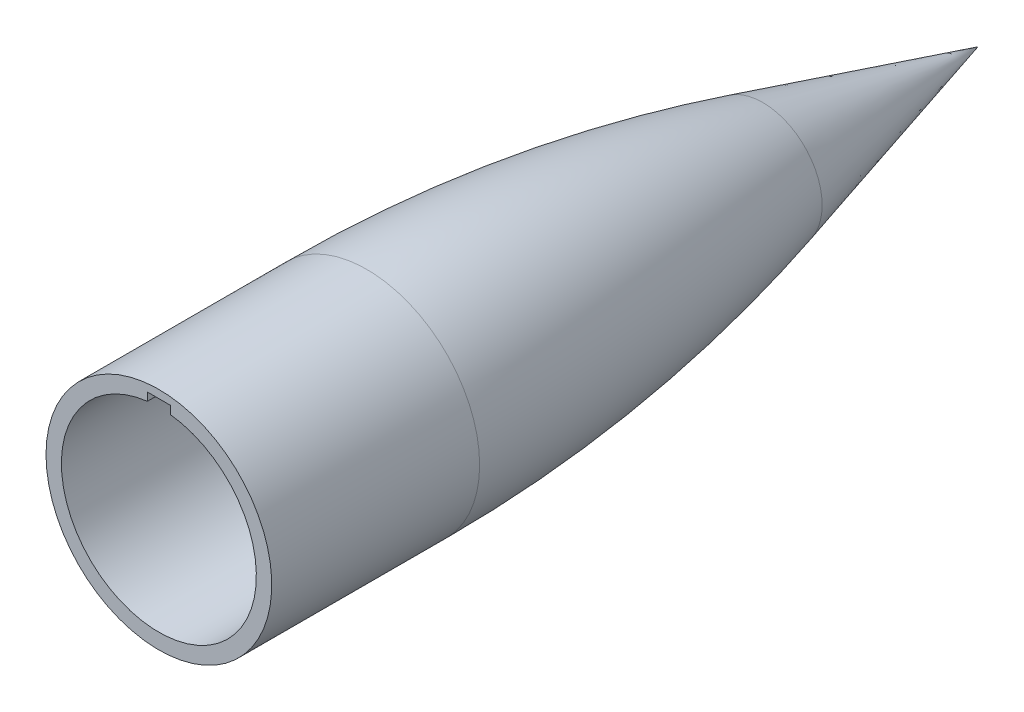
ISO-10303-21;
HEADER;
FILE_DESCRIPTION(('STEP AP214'),'2;1');
FILE_NAME('part.step','',(''),(''),'','','');
FILE_SCHEMA(('AUTOMOTIVE_DESIGN { 1 0 10303 214 1 1 1 1 }'));
ENDSEC;
DATA;
#1=APPLICATION_CONTEXT('core data for automotive mechanical design processes');
#2=APPLICATION_PROTOCOL_DEFINITION('international standard','automotive_design',2000,#1);
#3=PRODUCT_CONTEXT('',#1,'mechanical');
#4=PRODUCT('Part','Part','',(#3));
#5=PRODUCT_RELATED_PRODUCT_CATEGORY('part','',(#4));
#6=PRODUCT_DEFINITION_FORMATION('','',#4);
#7=PRODUCT_DEFINITION_CONTEXT('part definition',#1,'design');
#8=PRODUCT_DEFINITION('design','',#6,#7);
#9=PRODUCT_DEFINITION_SHAPE('','',#8);
#10=(LENGTH_UNIT() NAMED_UNIT(*) SI_UNIT(.MILLI.,.METRE.));
#11=(NAMED_UNIT(*) PLANE_ANGLE_UNIT() SI_UNIT($,.RADIAN.));
#12=(NAMED_UNIT(*) SI_UNIT($,.STERADIAN.) SOLID_ANGLE_UNIT());
#13=UNCERTAINTY_MEASURE_WITH_UNIT(LENGTH_MEASURE(1.E-05),#10,'distance_accuracy_value','');
#14=(GEOMETRIC_REPRESENTATION_CONTEXT(3) GLOBAL_UNCERTAINTY_ASSIGNED_CONTEXT((#13)) GLOBAL_UNIT_ASSIGNED_CONTEXT((#10,
#11,#12)) REPRESENTATION_CONTEXT('',''));
#15=CARTESIAN_POINT('',(0.,0.,0.));
#16=DIRECTION('',(0.,0.,1.));
#17=DIRECTION('',(1.,0.,0.));
#18=AXIS2_PLACEMENT_3D('',#15,#16,#17);
#19=CARTESIAN_POINT('',(0.,0.,0.));
#20=DIRECTION('',(0.,0.,1.));
#21=DIRECTION('',(1.,0.,0.));
#22=AXIS2_PLACEMENT_3D('',#19,#20,#21);
#23=PLANE('',#22);
#24=DIRECTION('',(0.,-1.,0.));
#25=VECTOR('',#24,1.);
#26=CARTESIAN_POINT('',(-1.778,12.7,0.));
#27=LINE('',#26,#25);
#28=CARTESIAN_POINT('',(-1.778,16.256,0.));
#29=VERTEX_POINT('',#28);
#30=CARTESIAN_POINT('',(-1.778,15.0080473413432,0.));
#31=VERTEX_POINT('',#30);
#32=EDGE_CURVE('E94',#29,#31,#27,.T.);
#33=ORIENTED_EDGE('',*,*,#32,.F.);
#34=DIRECTION('',(-1.,0.,0.));
#35=VECTOR('',#34,1.);
#36=CARTESIAN_POINT('',(-1.778,16.256,0.));
#37=LINE('',#36,#35);
#38=CARTESIAN_POINT('',(1.778,16.256,0.));
#39=VERTEX_POINT('',#38);
#40=EDGE_CURVE('E85',#39,#29,#37,.T.);
#41=ORIENTED_EDGE('',*,*,#40,.F.);
#42=DIRECTION('',(0.,1.,0.));
#43=VECTOR('',#42,1.);
#44=CARTESIAN_POINT('',(1.778,16.256,0.));
#45=LINE('',#44,#43);
#46=CARTESIAN_POINT('',(1.778,15.0080473413432,0.));
#47=VERTEX_POINT('',#46);
#48=EDGE_CURVE('E78',#47,#39,#45,.T.);
#49=ORIENTED_EDGE('',*,*,#48,.F.);
#50=CARTESIAN_POINT('',(0.,0.,0.));
#51=DIRECTION('',(0.,0.,1.));
#52=DIRECTION('',(1.,0.,0.));
#53=AXIS2_PLACEMENT_3D('',#50,#51,#52);
#54=CIRCLE('',#53,15.113);
#55=EDGE_CURVE('E104',#31,#47,#54,.T.);
#56=ORIENTED_EDGE('',*,*,#55,.F.);
#57=EDGE_LOOP('',(#33,#41,#49,#56));
#58=FACE_BOUND('',#57,.T.);
#59=CARTESIAN_POINT('',(0.,0.,0.));
#60=DIRECTION('',(0.,0.,-1.));
#61=DIRECTION('',(-1.,0.,0.));
#62=AXIS2_PLACEMENT_3D('',#59,#60,#61);
#63=CIRCLE('',#62,17.5);
#64=CARTESIAN_POINT('',(-17.5,0.,0.));
#65=VERTEX_POINT('',#64);
#66=EDGE_CURVE('E106',#65,#65,#63,.T.);
#67=ORIENTED_EDGE('',*,*,#66,.F.);
#68=EDGE_LOOP('',(#67));
#69=FACE_BOUND('',#68,.T.);
#70=ADVANCED_FACE('F32',(#58,#69),#23,.T.);
#71=CARTESIAN_POINT('',(0.,0.,-127.));
#72=DIRECTION('',(0.,0.,-1.));
#73=DIRECTION('',(-1.,0.,0.));
#74=AXIS2_PLACEMENT_3D('',#71,#72,#73);
#75=CYLINDRICAL_SURFACE('',#74,17.5);
#76=CARTESIAN_POINT('',(0.,0.,-32.2328228460768));
#77=DIRECTION('',(0.,0.,1.));
#78=DIRECTION('',(1.,0.,0.));
#79=AXIS2_PLACEMENT_3D('',#76,#77,#78);
#80=CIRCLE('',#79,17.5);
#81=CARTESIAN_POINT('',(17.5,0.,-32.2328228460768));
#82=VERTEX_POINT('',#81);
#83=EDGE_CURVE('E112',#82,#82,#80,.T.);
#84=ORIENTED_EDGE('',*,*,#83,.T.);
#85=EDGE_LOOP('',(#84));
#86=FACE_BOUND('',#85,.T.);
#87=ORIENTED_EDGE('',*,*,#66,.T.);
#88=EDGE_LOOP('',(#87));
#89=FACE_BOUND('',#88,.T.);
#90=ADVANCED_FACE('F153',(#86,#89),#75,.T.);
#91=CARTESIAN_POINT('',(0.,0.,-127.));
#92=DIRECTION('',(0.,0.,1.));
#93=DIRECTION('',(1.,0.,0.));
#94=AXIS2_PLACEMENT_3D('',#91,#92,#93);
#95=CONICAL_SURFACE('',#94,0.,0.26891515870072);
#96=CARTESIAN_POINT('',(0.,0.,-93.6434251287525));
#97=DIRECTION('',(0.,0.,-1.));
#98=DIRECTION('',(-1.,0.,0.));
#99=AXIS2_PLACEMENT_3D('',#96,#97,#98);
#100=CIRCLE('',#99,9.19275685428081);
#101=CARTESIAN_POINT('',(-9.19275685428081,0.,-93.6434251287525));
#102=VERTEX_POINT('',#101);
#103=EDGE_CURVE('E109',#102,#102,#100,.T.);
#104=ORIENTED_EDGE('',*,*,#103,.T.);
#105=EDGE_LOOP('',(#104));
#106=FACE_BOUND('',#105,.T.);
#107=CARTESIAN_POINT('',(0.,0.,-127.));
#108=VERTEX_POINT('',#107);
#109=VERTEX_LOOP('',#108);
#110=FACE_BOUND('',#109,.T.);
#111=ADVANCED_FACE('F150',(#106,#110),#95,.T.);
#112=CARTESIAN_POINT('',(0.,0.,-32.2328228460768));
#113=DIRECTION('',(0.,0.,1.));
#114=DIRECTION('',(1.,0.,0.));
#115=AXIS2_PLACEMENT_3D('',#112,#113,#114);
#116=DEGENERATE_TOROIDAL_SURFACE('',#115,213.639999999999,231.139999999999,.F.);
#117=ORIENTED_EDGE('',*,*,#83,.F.);
#118=EDGE_LOOP('',(#117));
#119=FACE_BOUND('',#118,.T.);
#120=ORIENTED_EDGE('',*,*,#103,.F.);
#121=EDGE_LOOP('',(#120));
#122=FACE_BOUND('',#121,.T.);
#123=ADVANCED_FACE('F148',(#119,#122),#116,.F.);
#124=CARTESIAN_POINT('',(0.,0.,-25.4));
#125=DIRECTION('',(0.,0.,1.));
#126=DIRECTION('',(1.,0.,0.));
#127=AXIS2_PLACEMENT_3D('',#124,#125,#126);
#128=CYLINDRICAL_SURFACE('',#127,15.113);
#129=CARTESIAN_POINT('',(0.,0.,-25.4));
#130=DIRECTION('',(0.,0.,-1.));
#131=DIRECTION('',(-1.,0.,0.));
#132=AXIS2_PLACEMENT_3D('',#129,#130,#131);
#133=CIRCLE('',#132,15.113);
#134=CARTESIAN_POINT('',(-15.113,0.,-25.4));
#135=VERTEX_POINT('',#134);
#136=EDGE_CURVE('E100',#135,#135,#133,.T.);
#137=ORIENTED_EDGE('',*,*,#136,.T.);
#138=EDGE_LOOP('',(#137));
#139=FACE_BOUND('',#138,.T.);
#140=CARTESIAN_POINT('',(0.,0.,-22.352));
#141=DIRECTION('',(0.,0.,-1.));
#142=DIRECTION('',(-1.,0.,0.));
#143=AXIS2_PLACEMENT_3D('',#140,#141,#142);
#144=CIRCLE('',#143,15.113);
#145=CARTESIAN_POINT('',(1.778,15.0080473413432,-22.352));
#146=VERTEX_POINT('',#145);
#147=CARTESIAN_POINT('',(-1.778,15.0080473413432,-22.352));
#148=VERTEX_POINT('',#147);
#149=EDGE_CURVE('E119',#146,#148,#144,.F.);
#150=ORIENTED_EDGE('',*,*,#149,.T.);
#151=DIRECTION('',(0.,0.,1.));
#152=VECTOR('',#151,1.);
#153=CARTESIAN_POINT('',(-1.778,15.0080473413432,-25.4));
#154=LINE('',#153,#152);
#155=EDGE_CURVE('E116',#148,#31,#154,.T.);
#156=ORIENTED_EDGE('',*,*,#155,.T.);
#157=ORIENTED_EDGE('',*,*,#55,.T.);
#158=DIRECTION('',(0.,0.,1.));
#159=VECTOR('',#158,1.);
#160=CARTESIAN_POINT('',(1.778,15.0080473413432,-25.4));
#161=LINE('',#160,#159);
#162=EDGE_CURVE('E80',#47,#146,#161,.F.);
#163=ORIENTED_EDGE('',*,*,#162,.T.);
#164=EDGE_LOOP('',(#150,#156,#157,#163));
#165=FACE_BOUND('',#164,.T.);
#166=ADVANCED_FACE('F144',(#139,#165),#128,.F.);
#167=CARTESIAN_POINT('',(225.77819581978,0.,-31.0632322908718));
#168=DIRECTION('',(0.,-1.,0.));
#169=DIRECTION('',(-1.,0.,0.));
#170=AXIS2_PLACEMENT_3D('',#167,#168,#169);
#171=CIRCLE('',#170,240.957756512348);
#172=TRIMMED_CURVE('',#171,(PARAMETER_VALUE(-0.356846031792619)),
(PARAMETER_VALUE(0.356846031792619)),.T.,.PARAMETER.);
#173=CARTESIAN_POINT('',(0.,0.,-31.0632322908718));
#174=DIRECTION('',(0.,0.,-1.));
#175=AXIS1_PLACEMENT('',#173,#174);
#176=SURFACE_OF_REVOLUTION('',#172,#175);
#177=ORIENTED_EDGE('',*,*,#136,.F.);
#178=EDGE_LOOP('',(#177));
#179=FACE_BOUND('',#178,.T.);
#180=CARTESIAN_POINT('',(0.,0.,-115.234763795467));
#181=VERTEX_POINT('',#180);
#182=VERTEX_LOOP('',#181);
#183=FACE_BOUND('',#182,.T.);
#184=ADVANCED_FACE('F135',(#179,#183),#176,.F.);
#185=CARTESIAN_POINT('',(-1.778,12.7,-19.812));
#186=DIRECTION('',(-1.,0.,0.));
#187=DIRECTION('',(0.,0.,1.));
#188=AXIS2_PLACEMENT_3D('',#185,#186,#187);
#189=PLANE('',#188);
#190=ORIENTED_EDGE('',*,*,#155,.F.);
#191=CARTESIAN_POINT('',(-1.778,15.0080473413432,-22.352));
#192=CARTESIAN_POINT('',(-1.778,15.2160922095546,-22.1453955487958));
#193=CARTESIAN_POINT('',(-1.778,15.4241106986152,-21.9387645480886));
#194=CARTESIAN_POINT('',(-1.778,15.8400949181673,-21.5254494479335));
#195=CARTESIAN_POINT('',(-1.778,16.0480606486591,-21.3187653484858));
#196=CARTESIAN_POINT('',(-1.778,16.256,-21.112054699535));
#197=B_SPLINE_CURVE_WITH_KNOTS('',3,(#191,#192,#193,#194,#195,#196),.UNSPECIFIED.,.F.,.F.,(4,2,
4),(0.,0.879609322482779,1.75921864383601),.UNSPECIFIED.);
#198=CARTESIAN_POINT('',(-1.778,16.256,-21.112054699535));
#199=VERTEX_POINT('',#198);
#200=EDGE_CURVE('E122',#148,#199,#197,.T.);
#201=ORIENTED_EDGE('',*,*,#200,.T.);
#202=DIRECTION('',(0.,0.,1.));
#203=VECTOR('',#202,1.);
#204=CARTESIAN_POINT('',(-1.778,16.256,-19.812));
#205=LINE('',#204,#203);
#206=EDGE_CURVE('E93',#199,#29,#205,.T.);
#207=ORIENTED_EDGE('',*,*,#206,.T.);
#208=ORIENTED_EDGE('',*,*,#32,.T.);
#209=EDGE_LOOP('',(#190,#201,#207,#208));
#210=FACE_BOUND('',#209,.T.);
#211=ADVANCED_FACE('F132',(#210),#189,.F.);
#212=CARTESIAN_POINT('',(1.778,16.256,-19.812));
#213=DIRECTION('',(1.,0.,0.));
#214=DIRECTION('',(0.,1.,0.));
#215=AXIS2_PLACEMENT_3D('',#212,#213,#214);
#216=PLANE('',#215);
#217=ORIENTED_EDGE('',*,*,#48,.T.);
#218=DIRECTION('',(0.,0.,1.));
#219=VECTOR('',#218,1.);
#220=CARTESIAN_POINT('',(1.778,16.256,-19.812));
#221=LINE('',#220,#219);
#222=CARTESIAN_POINT('',(1.778,16.256,-21.112054699535));
#223=VERTEX_POINT('',#222);
#224=EDGE_CURVE('E51',#223,#39,#221,.T.);
#225=ORIENTED_EDGE('',*,*,#224,.F.);
#226=CARTESIAN_POINT('',(1.778,16.256,-21.112054699535));
#227=CARTESIAN_POINT('',(1.778,16.0480606486591,-21.3187653484858));
#228=CARTESIAN_POINT('',(1.778,15.8400949181673,-21.5254494479335));
#229=CARTESIAN_POINT('',(1.778,15.4241106986152,-21.9387645480886));
#230=CARTESIAN_POINT('',(1.778,15.2160922095546,-22.1453955487958));
#231=CARTESIAN_POINT('',(1.778,15.0080473413432,-22.352));
#232=B_SPLINE_CURVE_WITH_KNOTS('',3,(#226,#227,#228,#229,#230,#231),.UNSPECIFIED.,.F.,.F.,(4,2,
4),(0.,0.879609321353227,1.75921864383601),.UNSPECIFIED.);
#233=EDGE_CURVE('E11',#223,#146,#232,.T.);
#234=ORIENTED_EDGE('',*,*,#233,.T.);
#235=ORIENTED_EDGE('',*,*,#162,.F.);
#236=EDGE_LOOP('',(#217,#225,#234,#235));
#237=FACE_BOUND('',#236,.T.);
#238=ADVANCED_FACE('F79',(#237),#216,.F.);
#239=CARTESIAN_POINT('',(-1.778,16.256,-19.812));
#240=DIRECTION('',(0.,1.,0.));
#241=DIRECTION('',(0.,0.,1.));
#242=AXIS2_PLACEMENT_3D('',#239,#240,#241);
#243=PLANE('',#242);
#244=ORIENTED_EDGE('',*,*,#40,.T.);
#245=ORIENTED_EDGE('',*,*,#206,.F.);
#246=CARTESIAN_POINT('',(-1.778,16.256,-21.112054699535));
#247=CARTESIAN_POINT('',(-1.48239780283544,16.256,-21.1442495682344));
#248=CARTESIAN_POINT('',(-1.18591680335895,16.256,-21.1685100537835));
#249=CARTESIAN_POINT('',(-0.592955474946374,16.256,-21.2008614641875));
#250=CARTESIAN_POINT('',(-0.296477737473186,16.256,-21.209));
#251=CARTESIAN_POINT('',(0.296477737473188,16.256,-21.209));
#252=CARTESIAN_POINT('',(0.592955474946375,16.256,-21.2008614641875));
#253=CARTESIAN_POINT('',(1.18591680335895,16.256,-21.1685100537835));
#254=CARTESIAN_POINT('',(1.48239780283544,16.256,-21.1442495682344));
#255=CARTESIAN_POINT('',(1.778,16.256,-21.112054699535));
#256=B_SPLINE_CURVE_WITH_KNOTS('',3,(#246,#247,#248,#249,#250,#251,#252,#253,#254,#255),
.UNSPECIFIED.,.F.,.F.,(4,2,2,2,4),(0.,0.891966922151464,1.78129575842682,2.67062459470218,
3.56259151685364),.UNSPECIFIED.);
#257=EDGE_CURVE('E46',#199,#223,#256,.T.);
#258=ORIENTED_EDGE('',*,*,#257,.T.);
#259=ORIENTED_EDGE('',*,*,#224,.T.);
#260=EDGE_LOOP('',(#244,#245,#258,#259));
#261=FACE_BOUND('',#260,.T.);
#262=ADVANCED_FACE('F89',(#261),#243,.F.);
#263=CARTESIAN_POINT('',(0.,0.,-22.352));
#264=DIRECTION('',(0.,0.,1.));
#265=DIRECTION('',(1.,0.,0.));
#266=AXIS2_PLACEMENT_3D('',#263,#264,#265);
#267=CONICAL_SURFACE('',#266,15.113,0.785398163397443);
#268=ORIENTED_EDGE('',*,*,#233,.F.);
#269=ORIENTED_EDGE('',*,*,#257,.F.);
#270=ORIENTED_EDGE('',*,*,#200,.F.);
#271=ORIENTED_EDGE('',*,*,#149,.F.);
#272=EDGE_LOOP('',(#268,#269,#270,#271));
#273=FACE_BOUND('',#272,.T.);
#274=ADVANCED_FACE('F34',(#273),#267,.F.);
#275=CLOSED_SHELL('',(#70,#90,#111,#123,#166,#184,#211,#238,#262,#274));
#276=MANIFOLD_SOLID_BREP('B2',#275);
#277=ADVANCED_BREP_SHAPE_REPRESENTATION('',(#18,#276),#14);
#278=SHAPE_DEFINITION_REPRESENTATION(#9,#277);
ENDSEC;
END-ISO-10303-21;
